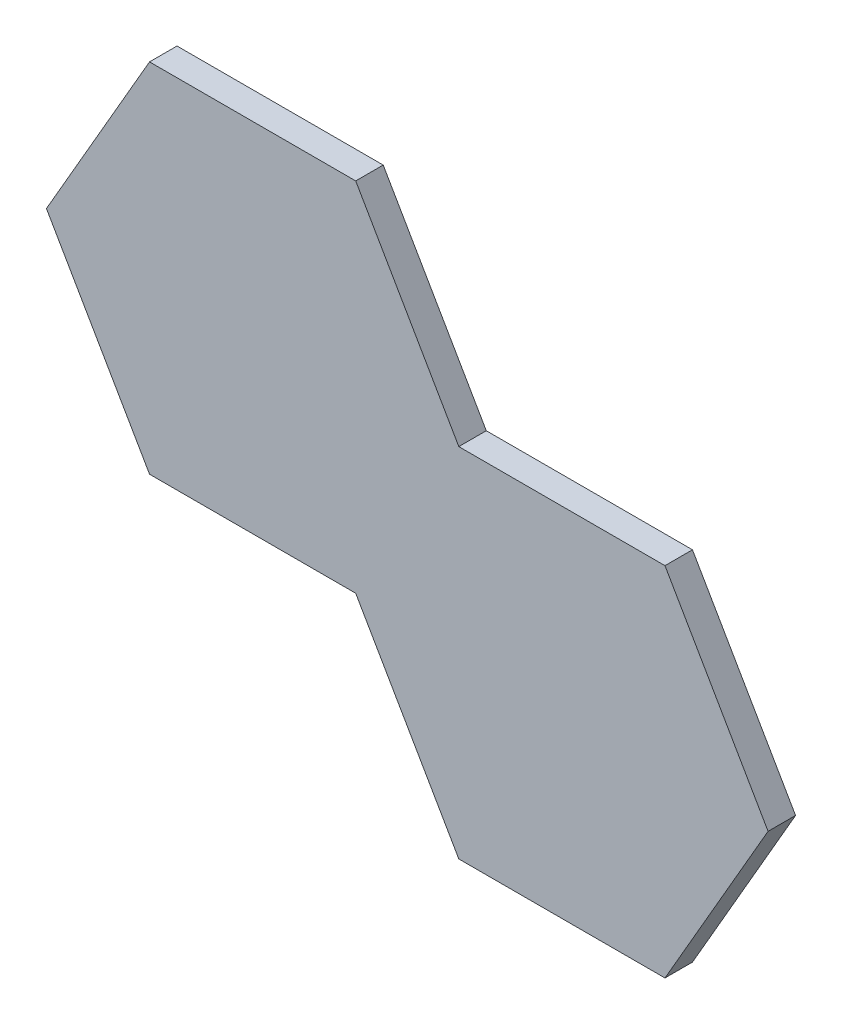
ISO-10303-21;
HEADER;
FILE_DESCRIPTION(('STEP AP214'),'2;1');
FILE_NAME('part.step','',(''),(''),'','','');
FILE_SCHEMA(('AUTOMOTIVE_DESIGN { 1 0 10303 214 1 1 1 1 }'));
ENDSEC;
DATA;
#1=APPLICATION_CONTEXT('core data for automotive mechanical design processes');
#2=APPLICATION_PROTOCOL_DEFINITION('international standard','automotive_design',2000,#1);
#3=PRODUCT_CONTEXT('',#1,'mechanical');
#4=PRODUCT('Part','Part','',(#3));
#5=PRODUCT_RELATED_PRODUCT_CATEGORY('part','',(#4));
#6=PRODUCT_DEFINITION_FORMATION('','',#4);
#7=PRODUCT_DEFINITION_CONTEXT('part definition',#1,'design');
#8=PRODUCT_DEFINITION('design','',#6,#7);
#9=PRODUCT_DEFINITION_SHAPE('','',#8);
#10=(LENGTH_UNIT() NAMED_UNIT(*) SI_UNIT(.MILLI.,.METRE.));
#11=(NAMED_UNIT(*) PLANE_ANGLE_UNIT() SI_UNIT($,.RADIAN.));
#12=(NAMED_UNIT(*) SI_UNIT($,.STERADIAN.) SOLID_ANGLE_UNIT());
#13=UNCERTAINTY_MEASURE_WITH_UNIT(LENGTH_MEASURE(1.E-05),#10,'distance_accuracy_value','');
#14=(GEOMETRIC_REPRESENTATION_CONTEXT(3) GLOBAL_UNCERTAINTY_ASSIGNED_CONTEXT((#13)) GLOBAL_UNIT_ASSIGNED_CONTEXT((#10,
#11,#12)) REPRESENTATION_CONTEXT('',''));
#15=CARTESIAN_POINT('',(0.,0.,0.));
#16=DIRECTION('',(0.,0.,1.));
#17=DIRECTION('',(1.,0.,0.));
#18=AXIS2_PLACEMENT_3D('',#15,#16,#17);
#19=CARTESIAN_POINT('',(20.,0.,-4.));
#20=DIRECTION('',(0.,0.,1.));
#21=DIRECTION('',(1.,0.,0.));
#22=AXIS2_PLACEMENT_3D('',#19,#20,#21);
#23=CYLINDRICAL_SURFACE('',#22,5.);
#24=CARTESIAN_POINT('',(20.,0.,-4.));
#25=DIRECTION('',(0.,0.,1.));
#26=DIRECTION('',(1.,0.,0.));
#27=AXIS2_PLACEMENT_3D('',#24,#25,#26);
#28=CIRCLE('',#27,5.);
#29=CARTESIAN_POINT('',(25.,0.,-4.));
#30=VERTEX_POINT('',#29);
#31=EDGE_CURVE('E146',#30,#30,#28,.F.);
#32=ORIENTED_EDGE('',*,*,#31,.T.);
#33=EDGE_LOOP('',(#32));
#34=FACE_BOUND('',#33,.T.);
#35=CARTESIAN_POINT('',(20.,0.,-2.));
#36=DIRECTION('',(0.,0.,1.));
#37=DIRECTION('',(1.,0.,0.));
#38=AXIS2_PLACEMENT_3D('',#35,#36,#37);
#39=CIRCLE('',#38,5.);
#40=CARTESIAN_POINT('',(25.,0.,-2.));
#41=VERTEX_POINT('',#40);
#42=EDGE_CURVE('E199',#41,#41,#39,.F.);
#43=ORIENTED_EDGE('',*,*,#42,.F.);
#44=EDGE_LOOP('',(#43));
#45=FACE_BOUND('',#44,.T.);
#46=ADVANCED_FACE('F35',(#34,#45),#23,.F.);
#47=CARTESIAN_POINT('',(-20.,0.,-4.));
#48=DIRECTION('',(0.,0.,1.));
#49=DIRECTION('',(1.,0.,0.));
#50=AXIS2_PLACEMENT_3D('',#47,#48,#49);
#51=CYLINDRICAL_SURFACE('',#50,5.);
#52=CARTESIAN_POINT('',(-20.,0.,-4.));
#53=DIRECTION('',(0.,0.,1.));
#54=DIRECTION('',(1.,0.,0.));
#55=AXIS2_PLACEMENT_3D('',#52,#53,#54);
#56=CIRCLE('',#55,5.);
#57=CARTESIAN_POINT('',(-15.,0.,-4.));
#58=VERTEX_POINT('',#57);
#59=EDGE_CURVE('E143',#58,#58,#56,.T.);
#60=ORIENTED_EDGE('',*,*,#59,.F.);
#61=EDGE_LOOP('',(#60));
#62=FACE_BOUND('',#61,.T.);
#63=CARTESIAN_POINT('',(-20.,0.,-2.));
#64=DIRECTION('',(0.,0.,1.));
#65=DIRECTION('',(1.,0.,0.));
#66=AXIS2_PLACEMENT_3D('',#63,#64,#65);
#67=CIRCLE('',#66,5.);
#68=CARTESIAN_POINT('',(-15.,0.,-2.));
#69=VERTEX_POINT('',#68);
#70=EDGE_CURVE('E11',#69,#69,#67,.F.);
#71=ORIENTED_EDGE('',*,*,#70,.F.);
#72=EDGE_LOOP('',(#71));
#73=FACE_BOUND('',#72,.T.);
#74=ADVANCED_FACE('F365',(#62,#73),#51,.F.);
#75=CARTESIAN_POINT('',(-22.5,12.9903810567666,-4.));
#76=DIRECTION('',(-0.866025403784438,0.5,0.));
#77=DIRECTION('',(-0.5,-0.866025403784439,0.));
#78=AXIS2_PLACEMENT_3D('',#75,#76,#77);
#79=PLANE('',#78);
#80=DIRECTION('',(-0.5,-0.866025403784439,0.));
#81=VECTOR('',#80,1.);
#82=CARTESIAN_POINT('',(-22.5,12.9903810567666,0.));
#83=LINE('',#82,#81);
#84=CARTESIAN_POINT('',(-15.,25.9807621135332,0.));
#85=VERTEX_POINT('',#84);
#86=CARTESIAN_POINT('',(-30.,0.,0.));
#87=VERTEX_POINT('',#86);
#88=EDGE_CURVE('E149',#85,#87,#83,.T.);
#89=ORIENTED_EDGE('',*,*,#88,.F.);
#90=DIRECTION('',(0.,0.,1.));
#91=VECTOR('',#90,1.);
#92=CARTESIAN_POINT('',(-15.,25.9807621135332,-4.));
#93=LINE('',#92,#91);
#94=CARTESIAN_POINT('',(-15.,25.9807621135332,-4.));
#95=VERTEX_POINT('',#94);
#96=EDGE_CURVE('E44',#95,#85,#93,.T.);
#97=ORIENTED_EDGE('',*,*,#96,.F.);
#98=DIRECTION('',(-0.5,-0.866025403784439,0.));
#99=VECTOR('',#98,1.);
#100=CARTESIAN_POINT('',(-22.5,12.9903810567666,-4.));
#101=LINE('',#100,#99);
#102=CARTESIAN_POINT('',(-30.,0.,-4.));
#103=VERTEX_POINT('',#102);
#104=EDGE_CURVE('E121',#95,#103,#101,.T.);
#105=ORIENTED_EDGE('',*,*,#104,.T.);
#106=DIRECTION('',(0.,0.,1.));
#107=VECTOR('',#106,1.);
#108=CARTESIAN_POINT('',(-30.,0.,-4.));
#109=LINE('',#108,#107);
#110=EDGE_CURVE('E88',#103,#87,#109,.T.);
#111=ORIENTED_EDGE('',*,*,#110,.T.);
#112=EDGE_LOOP('',(#89,#97,#105,#111));
#113=FACE_BOUND('',#112,.T.);
#114=ADVANCED_FACE('F37',(#113),#79,.T.);
#115=CARTESIAN_POINT('',(0.,25.9807621135332,-4.));
#116=DIRECTION('',(0.,1.,0.));
#117=DIRECTION('',(-1.,0.,0.));
#118=AXIS2_PLACEMENT_3D('',#115,#116,#117);
#119=PLANE('',#118);
#120=DIRECTION('',(-1.,0.,0.));
#121=VECTOR('',#120,1.);
#122=CARTESIAN_POINT('',(0.,25.9807621135332,0.));
#123=LINE('',#122,#121);
#124=CARTESIAN_POINT('',(15.,25.9807621135332,0.));
#125=VERTEX_POINT('',#124);
#126=EDGE_CURVE('E104',#125,#85,#123,.T.);
#127=ORIENTED_EDGE('',*,*,#126,.F.);
#128=DIRECTION('',(0.,0.,1.));
#129=VECTOR('',#128,1.);
#130=CARTESIAN_POINT('',(15.,25.9807621135332,-4.));
#131=LINE('',#130,#129);
#132=CARTESIAN_POINT('',(15.,25.9807621135332,-4.));
#133=VERTEX_POINT('',#132);
#134=EDGE_CURVE('E74',#133,#125,#131,.T.);
#135=ORIENTED_EDGE('',*,*,#134,.F.);
#136=DIRECTION('',(-1.,0.,0.));
#137=VECTOR('',#136,1.);
#138=CARTESIAN_POINT('',(0.,25.9807621135332,-4.));
#139=LINE('',#138,#137);
#140=EDGE_CURVE('E102',#133,#95,#139,.T.);
#141=ORIENTED_EDGE('',*,*,#140,.T.);
#142=ORIENTED_EDGE('',*,*,#96,.T.);
#143=EDGE_LOOP('',(#127,#135,#141,#142));
#144=FACE_BOUND('',#143,.T.);
#145=ADVANCED_FACE('F100',(#144),#119,.T.);
#146=CARTESIAN_POINT('',(22.5,12.9903810567666,-4.));
#147=DIRECTION('',(0.866025403784439,0.5,0.));
#148=DIRECTION('',(-0.5,0.866025403784439,0.));
#149=AXIS2_PLACEMENT_3D('',#146,#147,#148);
#150=PLANE('',#149);
#151=DIRECTION('',(-0.5,0.866025403784439,0.));
#152=VECTOR('',#151,1.);
#153=CARTESIAN_POINT('',(22.5,12.9903810567666,0.));
#154=LINE('',#153,#152);
#155=CARTESIAN_POINT('',(30.,0.,0.));
#156=VERTEX_POINT('',#155);
#157=EDGE_CURVE('E159',#156,#125,#154,.T.);
#158=ORIENTED_EDGE('',*,*,#157,.F.);
#159=DIRECTION('',(0.,0.,1.));
#160=VECTOR('',#159,1.);
#161=CARTESIAN_POINT('',(30.,0.,-4.));
#162=LINE('',#161,#160);
#163=CARTESIAN_POINT('',(30.,0.,-4.));
#164=VERTEX_POINT('',#163);
#165=EDGE_CURVE('E111',#164,#156,#162,.T.);
#166=ORIENTED_EDGE('',*,*,#165,.F.);
#167=DIRECTION('',(-0.5,0.866025403784439,0.));
#168=VECTOR('',#167,1.);
#169=CARTESIAN_POINT('',(22.5,12.9903810567666,-4.));
#170=LINE('',#169,#168);
#171=EDGE_CURVE('E108',#164,#133,#170,.T.);
#172=ORIENTED_EDGE('',*,*,#171,.T.);
#173=ORIENTED_EDGE('',*,*,#134,.T.);
#174=EDGE_LOOP('',(#158,#166,#172,#173));
#175=FACE_BOUND('',#174,.T.);
#176=ADVANCED_FACE('F109',(#175),#150,.T.);
#177=CARTESIAN_POINT('',(0.,-25.9807621135332,-4.));
#178=DIRECTION('',(0.,-1.,0.));
#179=DIRECTION('',(0.,0.,-1.));
#180=AXIS2_PLACEMENT_3D('',#177,#178,#179);
#181=PLANE('',#180);
#182=DIRECTION('',(1.,0.,0.));
#183=VECTOR('',#182,1.);
#184=CARTESIAN_POINT('',(0.,-25.9807621135332,0.));
#185=LINE('',#184,#183);
#186=CARTESIAN_POINT('',(-15.,-25.9807621135332,0.));
#187=VERTEX_POINT('',#186);
#188=CARTESIAN_POINT('',(15.,-25.9807621135332,0.));
#189=VERTEX_POINT('',#188);
#190=EDGE_CURVE('E156',#187,#189,#185,.T.);
#191=ORIENTED_EDGE('',*,*,#190,.F.);
#192=DIRECTION('',(0.,0.,1.));
#193=VECTOR('',#192,1.);
#194=CARTESIAN_POINT('',(-15.,-25.9807621135332,-4.));
#195=LINE('',#194,#193);
#196=CARTESIAN_POINT('',(-15.,-25.9807621135332,-4.));
#197=VERTEX_POINT('',#196);
#198=EDGE_CURVE('E105',#197,#187,#195,.T.);
#199=ORIENTED_EDGE('',*,*,#198,.F.);
#200=DIRECTION('',(1.,0.,0.));
#201=VECTOR('',#200,1.);
#202=CARTESIAN_POINT('',(0.,-25.9807621135332,-4.));
#203=LINE('',#202,#201);
#204=CARTESIAN_POINT('',(15.,-25.9807621135332,-4.));
#205=VERTEX_POINT('',#204);
#206=EDGE_CURVE('E115',#197,#205,#203,.T.);
#207=ORIENTED_EDGE('',*,*,#206,.T.);
#208=DIRECTION('',(0.,0.,1.));
#209=VECTOR('',#208,1.);
#210=CARTESIAN_POINT('',(15.,-25.9807621135332,-4.));
#211=LINE('',#210,#209);
#212=EDGE_CURVE('E182',#205,#189,#211,.T.);
#213=ORIENTED_EDGE('',*,*,#212,.T.);
#214=EDGE_LOOP('',(#191,#199,#207,#213));
#215=FACE_BOUND('',#214,.T.);
#216=ADVANCED_FACE('F239',(#215),#181,.T.);
#217=CARTESIAN_POINT('',(-22.5,-12.9903810567666,-4.));
#218=DIRECTION('',(-0.866025403784439,-0.5,0.));
#219=DIRECTION('',(0.5,-0.866025403784439,0.));
#220=AXIS2_PLACEMENT_3D('',#217,#218,#219);
#221=PLANE('',#220);
#222=DIRECTION('',(0.5,-0.866025403784439,0.));
#223=VECTOR('',#222,1.);
#224=CARTESIAN_POINT('',(-22.5,-12.9903810567666,0.));
#225=LINE('',#224,#223);
#226=EDGE_CURVE('E152',#87,#187,#225,.T.);
#227=ORIENTED_EDGE('',*,*,#226,.F.);
#228=ORIENTED_EDGE('',*,*,#110,.F.);
#229=DIRECTION('',(0.5,-0.866025403784439,0.));
#230=VECTOR('',#229,1.);
#231=CARTESIAN_POINT('',(-22.5,-12.9903810567666,-4.));
#232=LINE('',#231,#230);
#233=EDGE_CURVE('E235',#103,#197,#232,.T.);
#234=ORIENTED_EDGE('',*,*,#233,.T.);
#235=ORIENTED_EDGE('',*,*,#198,.T.);
#236=EDGE_LOOP('',(#227,#228,#234,#235));
#237=FACE_BOUND('',#236,.T.);
#238=ADVANCED_FACE('F164',(#237),#221,.T.);
#239=CARTESIAN_POINT('',(0.,0.,-4.));
#240=DIRECTION('',(0.,0.,1.));
#241=DIRECTION('',(1.,0.,0.));
#242=AXIS2_PLACEMENT_3D('',#239,#240,#241);
#243=PLANE('',#242);
#244=ORIENTED_EDGE('',*,*,#104,.F.);
#245=ORIENTED_EDGE('',*,*,#140,.F.);
#246=ORIENTED_EDGE('',*,*,#171,.F.);
#247=DIRECTION('',(1.,0.,0.));
#248=VECTOR('',#247,1.);
#249=CARTESIAN_POINT('',(45.,0.,-4.));
#250=LINE('',#249,#248);
#251=CARTESIAN_POINT('',(60.,0.,-4.));
#252=VERTEX_POINT('',#251);
#253=EDGE_CURVE('E180',#164,#252,#250,.T.);
#254=ORIENTED_EDGE('',*,*,#253,.T.);
#255=DIRECTION('',(0.5,-0.866025403784439,0.));
#256=VECTOR('',#255,1.);
#257=CARTESIAN_POINT('',(67.5,-12.9903810567666,-4.));
#258=LINE('',#257,#256);
#259=CARTESIAN_POINT('',(75.,-25.9807621135332,-4.));
#260=VERTEX_POINT('',#259);
#261=EDGE_CURVE('E310',#252,#260,#258,.T.);
#262=ORIENTED_EDGE('',*,*,#261,.T.);
#263=DIRECTION('',(-0.500000000000001,-0.866025403784439,0.));
#264=VECTOR('',#263,1.);
#265=CARTESIAN_POINT('',(67.5,-38.9711431702997,-4.));
#266=LINE('',#265,#264);
#267=CARTESIAN_POINT('',(60.,-51.9615242270663,-4.));
#268=VERTEX_POINT('',#267);
#269=EDGE_CURVE('E266',#260,#268,#266,.T.);
#270=ORIENTED_EDGE('',*,*,#269,.T.);
#271=DIRECTION('',(-1.,0.,0.));
#272=VECTOR('',#271,1.);
#273=CARTESIAN_POINT('',(45.,-51.9615242270663,-4.));
#274=LINE('',#273,#272);
#275=CARTESIAN_POINT('',(30.,-51.9615242270663,-4.));
#276=VERTEX_POINT('',#275);
#277=EDGE_CURVE('E247',#268,#276,#274,.T.);
#278=ORIENTED_EDGE('',*,*,#277,.T.);
#279=DIRECTION('',(-0.499999999999999,0.866025403784439,0.));
#280=VECTOR('',#279,1.);
#281=CARTESIAN_POINT('',(22.5,-38.9711431702997,-4.));
#282=LINE('',#281,#280);
#283=EDGE_CURVE('E243',#276,#205,#282,.T.);
#284=ORIENTED_EDGE('',*,*,#283,.T.);
#285=ORIENTED_EDGE('',*,*,#206,.F.);
#286=ORIENTED_EDGE('',*,*,#233,.F.);
#287=EDGE_LOOP('',(#244,#245,#246,#254,#262,#270,#278,#284,#285,#286));
#288=FACE_BOUND('',#287,.T.);
#289=DIRECTION('',(0.5,-0.866025403784439,0.));
#290=VECTOR('',#289,1.);
#291=CARTESIAN_POINT('',(-7.5,-4.33012701892219,-4.));
#292=LINE('',#291,#290);
#293=CARTESIAN_POINT('',(-10.,0.,-4.));
#294=VERTEX_POINT('',#293);
#295=CARTESIAN_POINT('',(-5.,-8.66025403784439,-4.));
#296=VERTEX_POINT('',#295);
#297=EDGE_CURVE('E122',#294,#296,#292,.T.);
#298=ORIENTED_EDGE('',*,*,#297,.T.);
#299=DIRECTION('',(1.,0.,0.));
#300=VECTOR('',#299,1.);
#301=CARTESIAN_POINT('',(0.,-8.66025403784439,-4.));
#302=LINE('',#301,#300);
#303=CARTESIAN_POINT('',(5.,-8.66025403784439,-4.));
#304=VERTEX_POINT('',#303);
#305=EDGE_CURVE('E140',#296,#304,#302,.T.);
#306=ORIENTED_EDGE('',*,*,#305,.T.);
#307=DIRECTION('',(0.5,0.866025403784439,0.));
#308=VECTOR('',#307,1.);
#309=CARTESIAN_POINT('',(7.5,-4.3301270189222,-4.));
#310=LINE('',#309,#308);
#311=CARTESIAN_POINT('',(10.,0.,-4.));
#312=VERTEX_POINT('',#311);
#313=EDGE_CURVE('E137',#304,#312,#310,.T.);
#314=ORIENTED_EDGE('',*,*,#313,.T.);
#315=DIRECTION('',(-0.5,0.866025403784439,0.));
#316=VECTOR('',#315,1.);
#317=CARTESIAN_POINT('',(7.50000000000001,4.33012701892219,-4.));
#318=LINE('',#317,#316);
#319=CARTESIAN_POINT('',(5.00000000000001,8.66025403784439,-4.));
#320=VERTEX_POINT('',#319);
#321=EDGE_CURVE('E134',#312,#320,#318,.T.);
#322=ORIENTED_EDGE('',*,*,#321,.T.);
#323=DIRECTION('',(-1.,0.,0.));
#324=VECTOR('',#323,1.);
#325=CARTESIAN_POINT('',(0.,8.66025403784439,-4.));
#326=LINE('',#325,#324);
#327=CARTESIAN_POINT('',(-5.,8.66025403784439,-4.));
#328=VERTEX_POINT('',#327);
#329=EDGE_CURVE('E131',#320,#328,#326,.T.);
#330=ORIENTED_EDGE('',*,*,#329,.T.);
#331=DIRECTION('',(-0.5,-0.866025403784439,0.));
#332=VECTOR('',#331,1.);
#333=CARTESIAN_POINT('',(-7.5,4.3301270189222,-4.));
#334=LINE('',#333,#332);
#335=EDGE_CURVE('E125',#328,#294,#334,.T.);
#336=ORIENTED_EDGE('',*,*,#335,.T.);
#337=EDGE_LOOP('',(#298,#306,#314,#322,#330,#336));
#338=FACE_BOUND('',#337,.T.);
#339=ORIENTED_EDGE('',*,*,#59,.T.);
#340=EDGE_LOOP('',(#339));
#341=FACE_BOUND('',#340,.T.);
#342=ORIENTED_EDGE('',*,*,#31,.F.);
#343=EDGE_LOOP('',(#342));
#344=FACE_BOUND('',#343,.T.);
#345=DIRECTION('',(-1.,0.,0.));
#346=VECTOR('',#345,1.);
#347=CARTESIAN_POINT('',(45.,-34.6410161513775,-4.));
#348=LINE('',#347,#346);
#349=CARTESIAN_POINT('',(50.,-34.6410161513775,-4.));
#350=VERTEX_POINT('',#349);
#351=CARTESIAN_POINT('',(40.,-34.6410161513775,-4.));
#352=VERTEX_POINT('',#351);
#353=EDGE_CURVE('E307',#350,#352,#348,.T.);
#354=ORIENTED_EDGE('',*,*,#353,.F.);
#355=DIRECTION('',(-0.500000000000001,-0.866025403784439,0.));
#356=VECTOR('',#355,1.);
#357=CARTESIAN_POINT('',(52.5,-30.3108891324554,-4.));
#358=LINE('',#357,#356);
#359=CARTESIAN_POINT('',(55.,-25.9807621135332,-4.));
#360=VERTEX_POINT('',#359);
#361=EDGE_CURVE('E304',#360,#350,#358,.T.);
#362=ORIENTED_EDGE('',*,*,#361,.F.);
#363=DIRECTION('',(0.499999999999999,-0.866025403784439,0.));
#364=VECTOR('',#363,1.);
#365=CARTESIAN_POINT('',(52.5,-21.650635094611,-4.));
#366=LINE('',#365,#364);
#367=CARTESIAN_POINT('',(50.,-17.3205080756888,-4.));
#368=VERTEX_POINT('',#367);
#369=EDGE_CURVE('E301',#368,#360,#366,.T.);
#370=ORIENTED_EDGE('',*,*,#369,.F.);
#371=DIRECTION('',(1.,0.,0.));
#372=VECTOR('',#371,1.);
#373=CARTESIAN_POINT('',(45.,-17.3205080756888,-4.));
#374=LINE('',#373,#372);
#375=CARTESIAN_POINT('',(40.,-17.3205080756888,-4.));
#376=VERTEX_POINT('',#375);
#377=EDGE_CURVE('E298',#376,#368,#374,.T.);
#378=ORIENTED_EDGE('',*,*,#377,.F.);
#379=DIRECTION('',(0.500000000000001,0.866025403784439,0.));
#380=VECTOR('',#379,1.);
#381=CARTESIAN_POINT('',(37.5,-21.650635094611,-4.));
#382=LINE('',#381,#380);
#383=CARTESIAN_POINT('',(35.,-25.9807621135332,-4.));
#384=VERTEX_POINT('',#383);
#385=EDGE_CURVE('E295',#384,#376,#382,.T.);
#386=ORIENTED_EDGE('',*,*,#385,.F.);
#387=DIRECTION('',(-0.499999999999999,0.866025403784439,0.));
#388=VECTOR('',#387,1.);
#389=CARTESIAN_POINT('',(37.5,-30.3108891324554,-4.));
#390=LINE('',#389,#388);
#391=EDGE_CURVE('E292',#352,#384,#390,.T.);
#392=ORIENTED_EDGE('',*,*,#391,.F.);
#393=EDGE_LOOP('',(#354,#362,#370,#378,#386,#392));
#394=FACE_BOUND('',#393,.T.);
#395=CARTESIAN_POINT('',(55.,-43.3012701892219,-4.));
#396=DIRECTION('',(0.,0.,-1.));
#397=DIRECTION('',(-0.499999999999999,0.866025403784439,0.));
#398=AXIS2_PLACEMENT_3D('',#395,#396,#397);
#399=CIRCLE('',#398,5.);
#400=CARTESIAN_POINT('',(52.5,-38.9711431702997,-4.));
#401=VERTEX_POINT('',#400);
#402=EDGE_CURVE('E289',#401,#401,#399,.T.);
#403=ORIENTED_EDGE('',*,*,#402,.F.);
#404=EDGE_LOOP('',(#403));
#405=FACE_BOUND('',#404,.T.);
#406=CARTESIAN_POINT('',(35.,-8.66025403784436,-4.));
#407=DIRECTION('',(0.,0.,-1.));
#408=DIRECTION('',(-0.499999999999999,0.866025403784439,0.));
#409=AXIS2_PLACEMENT_3D('',#406,#407,#408);
#410=CIRCLE('',#409,5.);
#411=CARTESIAN_POINT('',(32.5,-4.33012701892216,-4.));
#412=VERTEX_POINT('',#411);
#413=EDGE_CURVE('E195',#412,#412,#410,.F.);
#414=ORIENTED_EDGE('',*,*,#413,.T.);
#415=EDGE_LOOP('',(#414));
#416=FACE_BOUND('',#415,.T.);
#417=ADVANCED_FACE('F118',(#288,#338,#341,#344,#394,#405,#416),#243,.F.);
#418=CARTESIAN_POINT('',(0.,0.,0.));
#419=DIRECTION('',(0.,0.,1.));
#420=DIRECTION('',(1.,0.,0.));
#421=AXIS2_PLACEMENT_3D('',#418,#419,#420);
#422=PLANE('',#421);
#423=ORIENTED_EDGE('',*,*,#88,.T.);
#424=ORIENTED_EDGE('',*,*,#226,.T.);
#425=ORIENTED_EDGE('',*,*,#190,.T.);
#426=DIRECTION('',(-0.499999999999999,0.866025403784439,0.));
#427=VECTOR('',#426,1.);
#428=CARTESIAN_POINT('',(22.5,-38.9711431702997,0.));
#429=LINE('',#428,#427);
#430=CARTESIAN_POINT('',(30.,-51.9615242270663,0.));
#431=VERTEX_POINT('',#430);
#432=EDGE_CURVE('E254',#431,#189,#429,.T.);
#433=ORIENTED_EDGE('',*,*,#432,.F.);
#434=DIRECTION('',(-1.,0.,0.));
#435=VECTOR('',#434,1.);
#436=CARTESIAN_POINT('',(45.,-51.9615242270663,0.));
#437=LINE('',#436,#435);
#438=CARTESIAN_POINT('',(60.,-51.9615242270663,0.));
#439=VERTEX_POINT('',#438);
#440=EDGE_CURVE('E256',#439,#431,#437,.T.);
#441=ORIENTED_EDGE('',*,*,#440,.F.);
#442=DIRECTION('',(-0.500000000000001,-0.866025403784439,0.));
#443=VECTOR('',#442,1.);
#444=CARTESIAN_POINT('',(67.5,-38.9711431702997,0.));
#445=LINE('',#444,#443);
#446=CARTESIAN_POINT('',(75.,-25.9807621135332,0.));
#447=VERTEX_POINT('',#446);
#448=EDGE_CURVE('E261',#447,#439,#445,.T.);
#449=ORIENTED_EDGE('',*,*,#448,.F.);
#450=DIRECTION('',(0.5,-0.866025403784439,0.));
#451=VECTOR('',#450,1.);
#452=CARTESIAN_POINT('',(67.5,-12.9903810567666,0.));
#453=LINE('',#452,#451);
#454=CARTESIAN_POINT('',(60.,0.,0.));
#455=VERTEX_POINT('',#454);
#456=EDGE_CURVE('E258',#455,#447,#453,.T.);
#457=ORIENTED_EDGE('',*,*,#456,.F.);
#458=DIRECTION('',(1.,0.,0.));
#459=VECTOR('',#458,1.);
#460=CARTESIAN_POINT('',(45.,0.,0.));
#461=LINE('',#460,#459);
#462=EDGE_CURVE('E172',#156,#455,#461,.T.);
#463=ORIENTED_EDGE('',*,*,#462,.F.);
#464=ORIENTED_EDGE('',*,*,#157,.T.);
#465=ORIENTED_EDGE('',*,*,#126,.T.);
#466=EDGE_LOOP('',(#423,#424,#425,#433,#441,#449,#457,#463,#464,#465));
#467=FACE_BOUND('',#466,.T.);
#468=ADVANCED_FACE('F167',(#467),#422,.T.);
#469=CARTESIAN_POINT('',(-7.5,4.3301270189222,-8.));
#470=DIRECTION('',(-0.866025403784438,0.5,0.));
#471=DIRECTION('',(-0.5,-0.866025403784439,0.));
#472=AXIS2_PLACEMENT_3D('',#469,#470,#471);
#473=PLANE('',#472);
#474=ORIENTED_EDGE('',*,*,#335,.F.);
#475=DIRECTION('',(0.,0.,1.));
#476=VECTOR('',#475,1.);
#477=CARTESIAN_POINT('',(-5.,8.66025403784439,-8.));
#478=LINE('',#477,#476);
#479=CARTESIAN_POINT('',(-5.,8.66025403784439,-8.));
#480=VERTEX_POINT('',#479);
#481=EDGE_CURVE('E153',#480,#328,#478,.T.);
#482=ORIENTED_EDGE('',*,*,#481,.F.);
#483=DIRECTION('',(-0.5,-0.866025403784439,0.));
#484=VECTOR('',#483,1.);
#485=CARTESIAN_POINT('',(-7.5,4.3301270189222,-8.));
#486=LINE('',#485,#484);
#487=CARTESIAN_POINT('',(-10.,0.,-8.));
#488=VERTEX_POINT('',#487);
#489=EDGE_CURVE('E202',#480,#488,#486,.T.);
#490=ORIENTED_EDGE('',*,*,#489,.T.);
#491=DIRECTION('',(0.,0.,1.));
#492=VECTOR('',#491,1.);
#493=CARTESIAN_POINT('',(-10.,0.,-8.));
#494=LINE('',#493,#492);
#495=EDGE_CURVE('E219',#488,#294,#494,.T.);
#496=ORIENTED_EDGE('',*,*,#495,.T.);
#497=EDGE_LOOP('',(#474,#482,#490,#496));
#498=FACE_BOUND('',#497,.T.);
#499=ADVANCED_FACE('F389',(#498),#473,.T.);
#500=CARTESIAN_POINT('',(0.,8.66025403784439,-8.));
#501=DIRECTION('',(0.,1.,0.));
#502=DIRECTION('',(0.,0.,1.));
#503=AXIS2_PLACEMENT_3D('',#500,#501,#502);
#504=PLANE('',#503);
#505=ORIENTED_EDGE('',*,*,#329,.F.);
#506=DIRECTION('',(0.,0.,1.));
#507=VECTOR('',#506,1.);
#508=CARTESIAN_POINT('',(5.00000000000001,8.66025403784439,-8.));
#509=LINE('',#508,#507);
#510=CARTESIAN_POINT('',(5.00000000000001,8.66025403784439,-8.));
#511=VERTEX_POINT('',#510);
#512=EDGE_CURVE('E222',#511,#320,#509,.T.);
#513=ORIENTED_EDGE('',*,*,#512,.F.);
#514=DIRECTION('',(-1.,0.,0.));
#515=VECTOR('',#514,1.);
#516=CARTESIAN_POINT('',(0.,8.66025403784439,-8.));
#517=LINE('',#516,#515);
#518=EDGE_CURVE('E216',#511,#480,#517,.T.);
#519=ORIENTED_EDGE('',*,*,#518,.T.);
#520=ORIENTED_EDGE('',*,*,#481,.T.);
#521=EDGE_LOOP('',(#505,#513,#519,#520));
#522=FACE_BOUND('',#521,.T.);
#523=ADVANCED_FACE('F393',(#522),#504,.T.);
#524=CARTESIAN_POINT('',(7.50000000000001,4.33012701892219,-8.));
#525=DIRECTION('',(0.866025403784439,0.5,0.));
#526=DIRECTION('',(-0.5,0.866025403784439,0.));
#527=AXIS2_PLACEMENT_3D('',#524,#525,#526);
#528=PLANE('',#527);
#529=ORIENTED_EDGE('',*,*,#321,.F.);
#530=DIRECTION('',(0.,0.,1.));
#531=VECTOR('',#530,1.);
#532=CARTESIAN_POINT('',(10.,0.,-8.));
#533=LINE('',#532,#531);
#534=CARTESIAN_POINT('',(10.,0.,-8.));
#535=VERTEX_POINT('',#534);
#536=EDGE_CURVE('E225',#535,#312,#533,.T.);
#537=ORIENTED_EDGE('',*,*,#536,.F.);
#538=DIRECTION('',(-0.5,0.866025403784439,0.));
#539=VECTOR('',#538,1.);
#540=CARTESIAN_POINT('',(7.50000000000001,4.33012701892219,-8.));
#541=LINE('',#540,#539);
#542=EDGE_CURVE('E213',#535,#511,#541,.T.);
#543=ORIENTED_EDGE('',*,*,#542,.T.);
#544=ORIENTED_EDGE('',*,*,#512,.T.);
#545=EDGE_LOOP('',(#529,#537,#543,#544));
#546=FACE_BOUND('',#545,.T.);
#547=ADVANCED_FACE('F406',(#546),#528,.T.);
#548=CARTESIAN_POINT('',(7.5,-4.3301270189222,-8.));
#549=DIRECTION('',(0.866025403784438,-0.5,0.));
#550=DIRECTION('',(0.5,0.866025403784439,0.));
#551=AXIS2_PLACEMENT_3D('',#548,#549,#550);
#552=PLANE('',#551);
#553=ORIENTED_EDGE('',*,*,#313,.F.);
#554=DIRECTION('',(0.,0.,1.));
#555=VECTOR('',#554,1.);
#556=CARTESIAN_POINT('',(5.,-8.66025403784439,-8.));
#557=LINE('',#556,#555);
#558=CARTESIAN_POINT('',(5.,-8.66025403784439,-8.));
#559=VERTEX_POINT('',#558);
#560=EDGE_CURVE('E228',#559,#304,#557,.T.);
#561=ORIENTED_EDGE('',*,*,#560,.F.);
#562=DIRECTION('',(0.5,0.866025403784439,0.));
#563=VECTOR('',#562,1.);
#564=CARTESIAN_POINT('',(7.5,-4.3301270189222,-8.));
#565=LINE('',#564,#563);
#566=EDGE_CURVE('E210',#559,#535,#565,.T.);
#567=ORIENTED_EDGE('',*,*,#566,.T.);
#568=ORIENTED_EDGE('',*,*,#536,.T.);
#569=EDGE_LOOP('',(#553,#561,#567,#568));
#570=FACE_BOUND('',#569,.T.);
#571=ADVANCED_FACE('F402',(#570),#552,.T.);
#572=CARTESIAN_POINT('',(0.,-8.66025403784439,-8.));
#573=DIRECTION('',(0.,-1.,0.));
#574=DIRECTION('',(0.,0.,-1.));
#575=AXIS2_PLACEMENT_3D('',#572,#573,#574);
#576=PLANE('',#575);
#577=ORIENTED_EDGE('',*,*,#305,.F.);
#578=DIRECTION('',(0.,0.,1.));
#579=VECTOR('',#578,1.);
#580=CARTESIAN_POINT('',(-5.,-8.66025403784439,-8.));
#581=LINE('',#580,#579);
#582=CARTESIAN_POINT('',(-5.,-8.66025403784439,-8.));
#583=VERTEX_POINT('',#582);
#584=EDGE_CURVE('E52',#583,#296,#581,.T.);
#585=ORIENTED_EDGE('',*,*,#584,.F.);
#586=DIRECTION('',(1.,0.,0.));
#587=VECTOR('',#586,1.);
#588=CARTESIAN_POINT('',(0.,-8.66025403784439,-8.));
#589=LINE('',#588,#587);
#590=EDGE_CURVE('E207',#583,#559,#589,.T.);
#591=ORIENTED_EDGE('',*,*,#590,.T.);
#592=ORIENTED_EDGE('',*,*,#560,.T.);
#593=EDGE_LOOP('',(#577,#585,#591,#592));
#594=FACE_BOUND('',#593,.T.);
#595=ADVANCED_FACE('F399',(#594),#576,.T.);
#596=CARTESIAN_POINT('',(-7.5,-4.33012701892219,-8.));
#597=DIRECTION('',(-0.866025403784439,-0.5,0.));
#598=DIRECTION('',(0.5,-0.866025403784439,0.));
#599=AXIS2_PLACEMENT_3D('',#596,#597,#598);
#600=PLANE('',#599);
#601=ORIENTED_EDGE('',*,*,#297,.F.);
#602=ORIENTED_EDGE('',*,*,#495,.F.);
#603=DIRECTION('',(0.5,-0.866025403784439,0.));
#604=VECTOR('',#603,1.);
#605=CARTESIAN_POINT('',(-7.5,-4.33012701892219,-8.));
#606=LINE('',#605,#604);
#607=EDGE_CURVE('E205',#488,#583,#606,.T.);
#608=ORIENTED_EDGE('',*,*,#607,.T.);
#609=ORIENTED_EDGE('',*,*,#584,.T.);
#610=EDGE_LOOP('',(#601,#602,#608,#609));
#611=FACE_BOUND('',#610,.T.);
#612=ADVANCED_FACE('F395',(#611),#600,.T.);
#613=CARTESIAN_POINT('',(0.,0.,-8.));
#614=DIRECTION('',(0.,0.,1.));
#615=DIRECTION('',(1.,0.,0.));
#616=AXIS2_PLACEMENT_3D('',#613,#614,#615);
#617=PLANE('',#616);
#618=ORIENTED_EDGE('',*,*,#489,.F.);
#619=ORIENTED_EDGE('',*,*,#518,.F.);
#620=ORIENTED_EDGE('',*,*,#542,.F.);
#621=ORIENTED_EDGE('',*,*,#566,.F.);
#622=ORIENTED_EDGE('',*,*,#590,.F.);
#623=ORIENTED_EDGE('',*,*,#607,.F.);
#624=EDGE_LOOP('',(#618,#619,#620,#621,#622,#623));
#625=FACE_BOUND('',#624,.T.);
#626=ADVANCED_FACE('F398',(#625),#617,.F.);
#627=CARTESIAN_POINT('',(0.,0.,-2.));
#628=DIRECTION('',(0.,0.,1.));
#629=DIRECTION('',(1.,0.,0.));
#630=AXIS2_PLACEMENT_3D('',#627,#628,#629);
#631=PLANE('',#630);
#632=ORIENTED_EDGE('',*,*,#70,.T.);
#633=EDGE_LOOP('',(#632));
#634=FACE_BOUND('',#633,.T.);
#635=ADVANCED_FACE('F416',(#634),#631,.F.);
#636=CARTESIAN_POINT('',(0.,0.,-2.));
#637=DIRECTION('',(0.,0.,1.));
#638=DIRECTION('',(1.,0.,0.));
#639=AXIS2_PLACEMENT_3D('',#636,#637,#638);
#640=PLANE('',#639);
#641=ORIENTED_EDGE('',*,*,#42,.T.);
#642=EDGE_LOOP('',(#641));
#643=FACE_BOUND('',#642,.T.);
#644=ADVANCED_FACE('F420',(#643),#640,.F.);
#645=CARTESIAN_POINT('',(35.,-8.66025403784436,-4.));
#646=DIRECTION('',(0.,0.,1.));
#647=DIRECTION('',(-0.499999999999999,0.866025403784439,0.));
#648=AXIS2_PLACEMENT_3D('',#645,#646,#647);
#649=CYLINDRICAL_SURFACE('',#648,5.);
#650=ORIENTED_EDGE('',*,*,#413,.F.);
#651=EDGE_LOOP('',(#650));
#652=FACE_BOUND('',#651,.T.);
#653=CARTESIAN_POINT('',(35.,-8.66025403784436,-2.));
#654=DIRECTION('',(0.,0.,-1.));
#655=DIRECTION('',(-0.499999999999999,0.866025403784439,0.));
#656=AXIS2_PLACEMENT_3D('',#653,#654,#655);
#657=CIRCLE('',#656,5.);
#658=CARTESIAN_POINT('',(32.5,-4.33012701892216,-2.));
#659=VERTEX_POINT('',#658);
#660=EDGE_CURVE('E348',#659,#659,#657,.F.);
#661=ORIENTED_EDGE('',*,*,#660,.T.);
#662=EDGE_LOOP('',(#661));
#663=FACE_BOUND('',#662,.T.);
#664=ADVANCED_FACE('F352',(#652,#663),#649,.F.);
#665=CARTESIAN_POINT('',(55.,-43.3012701892219,-4.));
#666=DIRECTION('',(0.,0.,1.));
#667=DIRECTION('',(-0.499999999999999,0.866025403784439,0.));
#668=AXIS2_PLACEMENT_3D('',#665,#666,#667);
#669=CYLINDRICAL_SURFACE('',#668,5.);
#670=ORIENTED_EDGE('',*,*,#402,.T.);
#671=EDGE_LOOP('',(#670));
#672=FACE_BOUND('',#671,.T.);
#673=CARTESIAN_POINT('',(55.,-43.3012701892219,-2.));
#674=DIRECTION('',(0.,0.,-1.));
#675=DIRECTION('',(-0.499999999999999,0.866025403784439,0.));
#676=AXIS2_PLACEMENT_3D('',#673,#674,#675);
#677=CIRCLE('',#676,5.);
#678=CARTESIAN_POINT('',(52.5,-38.9711431702997,-2.));
#679=VERTEX_POINT('',#678);
#680=EDGE_CURVE('E196',#679,#679,#677,.F.);
#681=ORIENTED_EDGE('',*,*,#680,.T.);
#682=EDGE_LOOP('',(#681));
#683=FACE_BOUND('',#682,.T.);
#684=ADVANCED_FACE('F428',(#672,#683),#669,.F.);
#685=CARTESIAN_POINT('',(67.5,-38.9711431702997,-4.));
#686=DIRECTION('',(0.866025403784438,-0.5,0.));
#687=DIRECTION('',(-0.500000000000001,-0.866025403784439,0.));
#688=AXIS2_PLACEMENT_3D('',#685,#686,#687);
#689=PLANE('',#688);
#690=ORIENTED_EDGE('',*,*,#448,.T.);
#691=DIRECTION('',(0.,0.,1.));
#692=VECTOR('',#691,1.);
#693=CARTESIAN_POINT('',(60.,-51.9615242270663,-4.));
#694=LINE('',#693,#692);
#695=EDGE_CURVE('E192',#268,#439,#694,.T.);
#696=ORIENTED_EDGE('',*,*,#695,.F.);
#697=ORIENTED_EDGE('',*,*,#269,.F.);
#698=DIRECTION('',(0.,0.,1.));
#699=VECTOR('',#698,1.);
#700=CARTESIAN_POINT('',(75.,-25.9807621135332,-4.));
#701=LINE('',#700,#699);
#702=EDGE_CURVE('E184',#260,#447,#701,.T.);
#703=ORIENTED_EDGE('',*,*,#702,.T.);
#704=EDGE_LOOP('',(#690,#696,#697,#703));
#705=FACE_BOUND('',#704,.T.);
#706=ADVANCED_FACE('F274',(#705),#689,.T.);
#707=CARTESIAN_POINT('',(67.5,-12.9903810567666,-4.));
#708=DIRECTION('',(0.866025403784439,0.5,0.));
#709=DIRECTION('',(0.5,-0.866025403784439,0.));
#710=AXIS2_PLACEMENT_3D('',#707,#708,#709);
#711=PLANE('',#710);
#712=ORIENTED_EDGE('',*,*,#456,.T.);
#713=ORIENTED_EDGE('',*,*,#702,.F.);
#714=ORIENTED_EDGE('',*,*,#261,.F.);
#715=DIRECTION('',(0.,0.,1.));
#716=VECTOR('',#715,1.);
#717=CARTESIAN_POINT('',(60.,0.,-4.));
#718=LINE('',#717,#716);
#719=EDGE_CURVE('E181',#252,#455,#718,.T.);
#720=ORIENTED_EDGE('',*,*,#719,.T.);
#721=EDGE_LOOP('',(#712,#713,#714,#720));
#722=FACE_BOUND('',#721,.T.);
#723=ADVANCED_FACE('F427',(#722),#711,.T.);
#724=CARTESIAN_POINT('',(45.,0.,-4.));
#725=DIRECTION('',(0.,1.,0.));
#726=DIRECTION('',(1.,0.,0.));
#727=AXIS2_PLACEMENT_3D('',#724,#725,#726);
#728=PLANE('',#727);
#729=ORIENTED_EDGE('',*,*,#462,.T.);
#730=ORIENTED_EDGE('',*,*,#719,.F.);
#731=ORIENTED_EDGE('',*,*,#253,.F.);
#732=ORIENTED_EDGE('',*,*,#165,.T.);
#733=EDGE_LOOP('',(#729,#730,#731,#732));
#734=FACE_BOUND('',#733,.T.);
#735=ADVANCED_FACE('F177',(#734),#728,.T.);
#736=CARTESIAN_POINT('',(22.5,-38.9711431702997,-4.));
#737=DIRECTION('',(-0.866025403784439,-0.5,0.));
#738=DIRECTION('',(0.,0.,-1.));
#739=AXIS2_PLACEMENT_3D('',#736,#737,#738);
#740=PLANE('',#739);
#741=ORIENTED_EDGE('',*,*,#432,.T.);
#742=ORIENTED_EDGE('',*,*,#212,.F.);
#743=ORIENTED_EDGE('',*,*,#283,.F.);
#744=DIRECTION('',(0.,0.,1.));
#745=VECTOR('',#744,1.);
#746=CARTESIAN_POINT('',(30.,-51.9615242270663,-4.));
#747=LINE('',#746,#745);
#748=EDGE_CURVE('E186',#276,#431,#747,.T.);
#749=ORIENTED_EDGE('',*,*,#748,.T.);
#750=EDGE_LOOP('',(#741,#742,#743,#749));
#751=FACE_BOUND('',#750,.T.);
#752=ADVANCED_FACE('F252',(#751),#740,.T.);
#753=CARTESIAN_POINT('',(45.,-51.9615242270663,-4.));
#754=DIRECTION('',(0.,-1.,0.));
#755=DIRECTION('',(-1.,0.,0.));
#756=AXIS2_PLACEMENT_3D('',#753,#754,#755);
#757=PLANE('',#756);
#758=ORIENTED_EDGE('',*,*,#440,.T.);
#759=ORIENTED_EDGE('',*,*,#748,.F.);
#760=ORIENTED_EDGE('',*,*,#277,.F.);
#761=ORIENTED_EDGE('',*,*,#695,.T.);
#762=EDGE_LOOP('',(#758,#759,#760,#761));
#763=FACE_BOUND('',#762,.T.);
#764=ADVANCED_FACE('F429',(#763),#757,.T.);
#765=CARTESIAN_POINT('',(52.5,-30.3108891324554,-8.));
#766=DIRECTION('',(0.866025403784438,-0.5,0.));
#767=DIRECTION('',(-0.500000000000001,-0.866025403784439,0.));
#768=AXIS2_PLACEMENT_3D('',#765,#766,#767);
#769=PLANE('',#768);
#770=ORIENTED_EDGE('',*,*,#361,.T.);
#771=DIRECTION('',(0.,0.,1.));
#772=VECTOR('',#771,1.);
#773=CARTESIAN_POINT('',(50.,-34.6410161513775,-8.));
#774=LINE('',#773,#772);
#775=CARTESIAN_POINT('',(50.,-34.6410161513775,-8.));
#776=VERTEX_POINT('',#775);
#777=EDGE_CURVE('E316',#776,#350,#774,.T.);
#778=ORIENTED_EDGE('',*,*,#777,.F.);
#779=DIRECTION('',(-0.500000000000001,-0.866025403784439,0.));
#780=VECTOR('',#779,1.);
#781=CARTESIAN_POINT('',(52.5,-30.3108891324554,-8.));
#782=LINE('',#781,#780);
#783=CARTESIAN_POINT('',(55.,-25.9807621135332,-8.));
#784=VERTEX_POINT('',#783);
#785=EDGE_CURVE('E345',#784,#776,#782,.T.);
#786=ORIENTED_EDGE('',*,*,#785,.F.);
#787=DIRECTION('',(0.,0.,1.));
#788=VECTOR('',#787,1.);
#789=CARTESIAN_POINT('',(55.,-25.9807621135332,-8.));
#790=LINE('',#789,#788);
#791=EDGE_CURVE('E282',#784,#360,#790,.T.);
#792=ORIENTED_EDGE('',*,*,#791,.T.);
#793=EDGE_LOOP('',(#770,#778,#786,#792));
#794=FACE_BOUND('',#793,.T.);
#795=ADVANCED_FACE('F432',(#794),#769,.T.);
#796=CARTESIAN_POINT('',(52.5,-21.650635094611,-8.));
#797=DIRECTION('',(0.866025403784439,0.5,0.));
#798=DIRECTION('',(0.,0.,1.));
#799=AXIS2_PLACEMENT_3D('',#796,#797,#798);
#800=PLANE('',#799);
#801=ORIENTED_EDGE('',*,*,#369,.T.);
#802=ORIENTED_EDGE('',*,*,#791,.F.);
#803=DIRECTION('',(0.499999999999999,-0.866025403784439,0.));
#804=VECTOR('',#803,1.);
#805=CARTESIAN_POINT('',(52.5,-21.650635094611,-8.));
#806=LINE('',#805,#804);
#807=CARTESIAN_POINT('',(50.,-17.3205080756888,-8.));
#808=VERTEX_POINT('',#807);
#809=EDGE_CURVE('E320',#808,#784,#806,.T.);
#810=ORIENTED_EDGE('',*,*,#809,.F.);
#811=DIRECTION('',(0.,0.,1.));
#812=VECTOR('',#811,1.);
#813=CARTESIAN_POINT('',(50.,-17.3205080756888,-8.));
#814=LINE('',#813,#812);
#815=EDGE_CURVE('E284',#808,#368,#814,.T.);
#816=ORIENTED_EDGE('',*,*,#815,.T.);
#817=EDGE_LOOP('',(#801,#802,#810,#816));
#818=FACE_BOUND('',#817,.T.);
#819=ADVANCED_FACE('F448',(#818),#800,.T.);
#820=CARTESIAN_POINT('',(45.,-17.3205080756888,-8.));
#821=DIRECTION('',(0.,1.,0.));
#822=DIRECTION('',(1.,0.,0.));
#823=AXIS2_PLACEMENT_3D('',#820,#821,#822);
#824=PLANE('',#823);
#825=ORIENTED_EDGE('',*,*,#377,.T.);
#826=ORIENTED_EDGE('',*,*,#815,.F.);
#827=DIRECTION('',(1.,0.,0.));
#828=VECTOR('',#827,1.);
#829=CARTESIAN_POINT('',(45.,-17.3205080756888,-8.));
#830=LINE('',#829,#828);
#831=CARTESIAN_POINT('',(40.,-17.3205080756888,-8.));
#832=VERTEX_POINT('',#831);
#833=EDGE_CURVE('E333',#832,#808,#830,.T.);
#834=ORIENTED_EDGE('',*,*,#833,.F.);
#835=DIRECTION('',(0.,0.,1.));
#836=VECTOR('',#835,1.);
#837=CARTESIAN_POINT('',(40.,-17.3205080756888,-8.));
#838=LINE('',#837,#836);
#839=EDGE_CURVE('E326',#832,#376,#838,.T.);
#840=ORIENTED_EDGE('',*,*,#839,.T.);
#841=EDGE_LOOP('',(#825,#826,#834,#840));
#842=FACE_BOUND('',#841,.T.);
#843=ADVANCED_FACE('F461',(#842),#824,.T.);
#844=CARTESIAN_POINT('',(37.5,-21.650635094611,-8.));
#845=DIRECTION('',(-0.866025403784438,0.5,0.));
#846=DIRECTION('',(0.500000000000001,0.866025403784439,0.));
#847=AXIS2_PLACEMENT_3D('',#844,#845,#846);
#848=PLANE('',#847);
#849=ORIENTED_EDGE('',*,*,#385,.T.);
#850=ORIENTED_EDGE('',*,*,#839,.F.);
#851=DIRECTION('',(0.500000000000001,0.866025403784439,0.));
#852=VECTOR('',#851,1.);
#853=CARTESIAN_POINT('',(37.5,-21.650635094611,-8.));
#854=LINE('',#853,#852);
#855=CARTESIAN_POINT('',(35.,-25.9807621135332,-8.));
#856=VERTEX_POINT('',#855);
#857=EDGE_CURVE('E336',#856,#832,#854,.T.);
#858=ORIENTED_EDGE('',*,*,#857,.F.);
#859=DIRECTION('',(0.,0.,1.));
#860=VECTOR('',#859,1.);
#861=CARTESIAN_POINT('',(35.,-25.9807621135332,-8.));
#862=LINE('',#861,#860);
#863=EDGE_CURVE('E323',#856,#384,#862,.T.);
#864=ORIENTED_EDGE('',*,*,#863,.T.);
#865=EDGE_LOOP('',(#849,#850,#858,#864));
#866=FACE_BOUND('',#865,.T.);
#867=ADVANCED_FACE('F457',(#866),#848,.T.);
#868=CARTESIAN_POINT('',(37.5,-30.3108891324554,-8.));
#869=DIRECTION('',(-0.866025403784439,-0.5,0.));
#870=DIRECTION('',(0.,0.,-1.));
#871=AXIS2_PLACEMENT_3D('',#868,#869,#870);
#872=PLANE('',#871);
#873=ORIENTED_EDGE('',*,*,#391,.T.);
#874=ORIENTED_EDGE('',*,*,#863,.F.);
#875=DIRECTION('',(-0.499999999999999,0.866025403784439,0.));
#876=VECTOR('',#875,1.);
#877=CARTESIAN_POINT('',(37.5,-30.3108891324554,-8.));
#878=LINE('',#877,#876);
#879=CARTESIAN_POINT('',(40.,-34.6410161513775,-8.));
#880=VERTEX_POINT('',#879);
#881=EDGE_CURVE('E339',#880,#856,#878,.T.);
#882=ORIENTED_EDGE('',*,*,#881,.F.);
#883=DIRECTION('',(0.,0.,1.));
#884=VECTOR('',#883,1.);
#885=CARTESIAN_POINT('',(40.,-34.6410161513775,-8.));
#886=LINE('',#885,#884);
#887=EDGE_CURVE('E319',#880,#352,#886,.T.);
#888=ORIENTED_EDGE('',*,*,#887,.T.);
#889=EDGE_LOOP('',(#873,#874,#882,#888));
#890=FACE_BOUND('',#889,.T.);
#891=ADVANCED_FACE('F453',(#890),#872,.T.);
#892=CARTESIAN_POINT('',(45.,-34.6410161513775,-8.));
#893=DIRECTION('',(0.,-1.,0.));
#894=DIRECTION('',(-1.,0.,0.));
#895=AXIS2_PLACEMENT_3D('',#892,#893,#894);
#896=PLANE('',#895);
#897=ORIENTED_EDGE('',*,*,#353,.T.);
#898=ORIENTED_EDGE('',*,*,#887,.F.);
#899=DIRECTION('',(-1.,0.,0.));
#900=VECTOR('',#899,1.);
#901=CARTESIAN_POINT('',(45.,-34.6410161513775,-8.));
#902=LINE('',#901,#900);
#903=EDGE_CURVE('E342',#776,#880,#902,.T.);
#904=ORIENTED_EDGE('',*,*,#903,.F.);
#905=ORIENTED_EDGE('',*,*,#777,.T.);
#906=EDGE_LOOP('',(#897,#898,#904,#905));
#907=FACE_BOUND('',#906,.T.);
#908=ADVANCED_FACE('F450',(#907),#896,.T.);
#909=CARTESIAN_POINT('',(45.,-25.9807621135332,-8.));
#910=DIRECTION('',(0.,0.,1.));
#911=DIRECTION('',(-0.499999999999999,0.866025403784439,0.));
#912=AXIS2_PLACEMENT_3D('',#909,#910,#911);
#913=PLANE('',#912);
#914=ORIENTED_EDGE('',*,*,#785,.T.);
#915=ORIENTED_EDGE('',*,*,#903,.T.);
#916=ORIENTED_EDGE('',*,*,#881,.T.);
#917=ORIENTED_EDGE('',*,*,#857,.T.);
#918=ORIENTED_EDGE('',*,*,#833,.T.);
#919=ORIENTED_EDGE('',*,*,#809,.T.);
#920=EDGE_LOOP('',(#914,#915,#916,#917,#918,#919));
#921=FACE_BOUND('',#920,.T.);
#922=ADVANCED_FACE('F361',(#921),#913,.F.);
#923=CARTESIAN_POINT('',(45.,-25.9807621135332,-2.));
#924=DIRECTION('',(0.,0.,1.));
#925=DIRECTION('',(-0.499999999999999,0.866025403784439,0.));
#926=AXIS2_PLACEMENT_3D('',#923,#924,#925);
#927=PLANE('',#926);
#928=ORIENTED_EDGE('',*,*,#680,.F.);
#929=EDGE_LOOP('',(#928));
#930=FACE_BOUND('',#929,.T.);
#931=ADVANCED_FACE('F356',(#930),#927,.F.);
#932=CARTESIAN_POINT('',(45.,-25.9807621135332,-2.));
#933=DIRECTION('',(0.,0.,1.));
#934=DIRECTION('',(-0.499999999999999,0.866025403784439,0.));
#935=AXIS2_PLACEMENT_3D('',#932,#933,#934);
#936=PLANE('',#935);
#937=ORIENTED_EDGE('',*,*,#660,.F.);
#938=EDGE_LOOP('',(#937));
#939=FACE_BOUND('',#938,.T.);
#940=ADVANCED_FACE('F354',(#939),#936,.F.);
#941=CLOSED_SHELL('',(#46,#74,#114,#145,#176,#216,#238,#417,#468,#499,#523,#547,#571,#595,#612,
#626,#635,#644,#664,#684,#706,#723,#735,#752,#764,#795,#819,#843,#867,#891,#908,#922,#931,#940));
#942=MANIFOLD_SOLID_BREP('B2',#941);
#943=ADVANCED_BREP_SHAPE_REPRESENTATION('',(#18,#942),#14);
#944=SHAPE_DEFINITION_REPRESENTATION(#9,#943);
ENDSEC;
END-ISO-10303-21;
